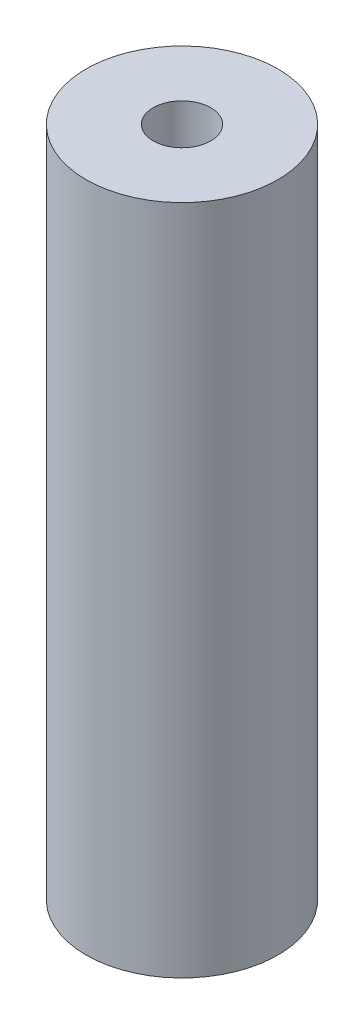
ISO-10303-21;
HEADER;
FILE_DESCRIPTION(('STEP AP214'),'2;1');
FILE_NAME('part.step','',(''),(''),'','','');
FILE_SCHEMA(('AUTOMOTIVE_DESIGN { 1 0 10303 214 1 1 1 1 }'));
ENDSEC;
DATA;
#1=APPLICATION_CONTEXT('core data for automotive mechanical design processes');
#2=APPLICATION_PROTOCOL_DEFINITION('international standard','automotive_design',2000,#1);
#3=PRODUCT_CONTEXT('',#1,'mechanical');
#4=PRODUCT('Part','Part','',(#3));
#5=PRODUCT_RELATED_PRODUCT_CATEGORY('part','',(#4));
#6=PRODUCT_DEFINITION_FORMATION('','',#4);
#7=PRODUCT_DEFINITION_CONTEXT('part definition',#1,'design');
#8=PRODUCT_DEFINITION('design','',#6,#7);
#9=PRODUCT_DEFINITION_SHAPE('','',#8);
#10=(LENGTH_UNIT() NAMED_UNIT(*) SI_UNIT(.MILLI.,.METRE.));
#11=(NAMED_UNIT(*) PLANE_ANGLE_UNIT() SI_UNIT($,.RADIAN.));
#12=(NAMED_UNIT(*) SI_UNIT($,.STERADIAN.) SOLID_ANGLE_UNIT());
#13=UNCERTAINTY_MEASURE_WITH_UNIT(LENGTH_MEASURE(1.E-05),#10,'distance_accuracy_value','');
#14=(GEOMETRIC_REPRESENTATION_CONTEXT(3) GLOBAL_UNCERTAINTY_ASSIGNED_CONTEXT((#13)) GLOBAL_UNIT_ASSIGNED_CONTEXT((#10,
#11,#12)) REPRESENTATION_CONTEXT('',''));
#15=CARTESIAN_POINT('',(0.,0.,0.));
#16=DIRECTION('',(0.,0.,1.));
#17=DIRECTION('',(1.,0.,0.));
#18=AXIS2_PLACEMENT_3D('',#15,#16,#17);
#19=CARTESIAN_POINT('',(0.,35.,0.));
#20=DIRECTION('',(0.,1.,0.));
#21=DIRECTION('',(0.,0.,1.));
#22=AXIS2_PLACEMENT_3D('',#19,#20,#21);
#23=PLANE('',#22);
#24=CARTESIAN_POINT('',(0.,35.,0.));
#25=DIRECTION('',(0.,1.,0.));
#26=DIRECTION('',(0.,0.,1.));
#27=AXIS2_PLACEMENT_3D('',#24,#25,#26);
#28=CIRCLE('',#27,5.);
#29=CARTESIAN_POINT('',(0.,35.,5.));
#30=VERTEX_POINT('',#29);
#31=EDGE_CURVE('E10',#30,#30,#28,.T.);
#32=ORIENTED_EDGE('',*,*,#31,.T.);
#33=EDGE_LOOP('',(#32));
#34=FACE_BOUND('',#33,.T.);
#35=CARTESIAN_POINT('',(0.,35.,0.));
#36=DIRECTION('',(0.,1.,0.));
#37=DIRECTION('',(0.,0.,1.));
#38=AXIS2_PLACEMENT_3D('',#35,#36,#37);
#39=CIRCLE('',#38,1.5);
#40=CARTESIAN_POINT('',(0.,35.,1.5));
#41=VERTEX_POINT('',#40);
#42=EDGE_CURVE('E48',#41,#41,#39,.T.);
#43=ORIENTED_EDGE('',*,*,#42,.F.);
#44=EDGE_LOOP('',(#43));
#45=FACE_BOUND('',#44,.T.);
#46=ADVANCED_FACE('F37',(#34,#45),#23,.T.);
#47=CARTESIAN_POINT('',(0.,0.,0.));
#48=DIRECTION('',(0.,1.,0.));
#49=DIRECTION('',(0.,0.,1.));
#50=AXIS2_PLACEMENT_3D('',#47,#48,#49);
#51=PLANE('',#50);
#52=CARTESIAN_POINT('',(0.,0.,0.));
#53=DIRECTION('',(0.,1.,0.));
#54=DIRECTION('',(0.,0.,1.));
#55=AXIS2_PLACEMENT_3D('',#52,#53,#54);
#56=CIRCLE('',#55,5.);
#57=CARTESIAN_POINT('',(0.,0.,5.));
#58=VERTEX_POINT('',#57);
#59=EDGE_CURVE('E41',#58,#58,#56,.T.);
#60=ORIENTED_EDGE('',*,*,#59,.F.);
#61=EDGE_LOOP('',(#60));
#62=FACE_BOUND('',#61,.T.);
#63=CARTESIAN_POINT('',(0.,0.,0.));
#64=DIRECTION('',(0.,1.,0.));
#65=DIRECTION('',(0.,0.,1.));
#66=AXIS2_PLACEMENT_3D('',#63,#64,#65);
#67=CIRCLE('',#66,1.5);
#68=CARTESIAN_POINT('',(0.,0.,1.5));
#69=VERTEX_POINT('',#68);
#70=EDGE_CURVE('E50',#69,#69,#67,.T.);
#71=ORIENTED_EDGE('',*,*,#70,.T.);
#72=EDGE_LOOP('',(#71));
#73=FACE_BOUND('',#72,.T.);
#74=ADVANCED_FACE('F60',(#62,#73),#51,.F.);
#75=CARTESIAN_POINT('',(0.,35.,0.));
#76=DIRECTION('',(0.,-1.,0.));
#77=DIRECTION('',(0.,0.,-1.));
#78=AXIS2_PLACEMENT_3D('',#75,#76,#77);
#79=CYLINDRICAL_SURFACE('',#78,5.);
#80=ORIENTED_EDGE('',*,*,#31,.F.);
#81=EDGE_LOOP('',(#80));
#82=FACE_BOUND('',#81,.T.);
#83=ORIENTED_EDGE('',*,*,#59,.T.);
#84=EDGE_LOOP('',(#83));
#85=FACE_BOUND('',#84,.T.);
#86=ADVANCED_FACE('F39',(#82,#85),#79,.T.);
#87=CARTESIAN_POINT('',(0.,35.,0.));
#88=DIRECTION('',(0.,-1.,0.));
#89=DIRECTION('',(0.,0.,-1.));
#90=AXIS2_PLACEMENT_3D('',#87,#88,#89);
#91=CYLINDRICAL_SURFACE('',#90,1.5);
#92=ORIENTED_EDGE('',*,*,#42,.T.);
#93=EDGE_LOOP('',(#92));
#94=FACE_BOUND('',#93,.T.);
#95=ORIENTED_EDGE('',*,*,#70,.F.);
#96=EDGE_LOOP('',(#95));
#97=FACE_BOUND('',#96,.T.);
#98=ADVANCED_FACE('F56',(#94,#97),#91,.F.);
#99=CLOSED_SHELL('',(#46,#74,#86,#98));
#100=MANIFOLD_SOLID_BREP('B2',#99);
#101=ADVANCED_BREP_SHAPE_REPRESENTATION('',(#18,#100),#14);
#102=SHAPE_DEFINITION_REPRESENTATION(#9,#101);
ENDSEC;
END-ISO-10303-21;
